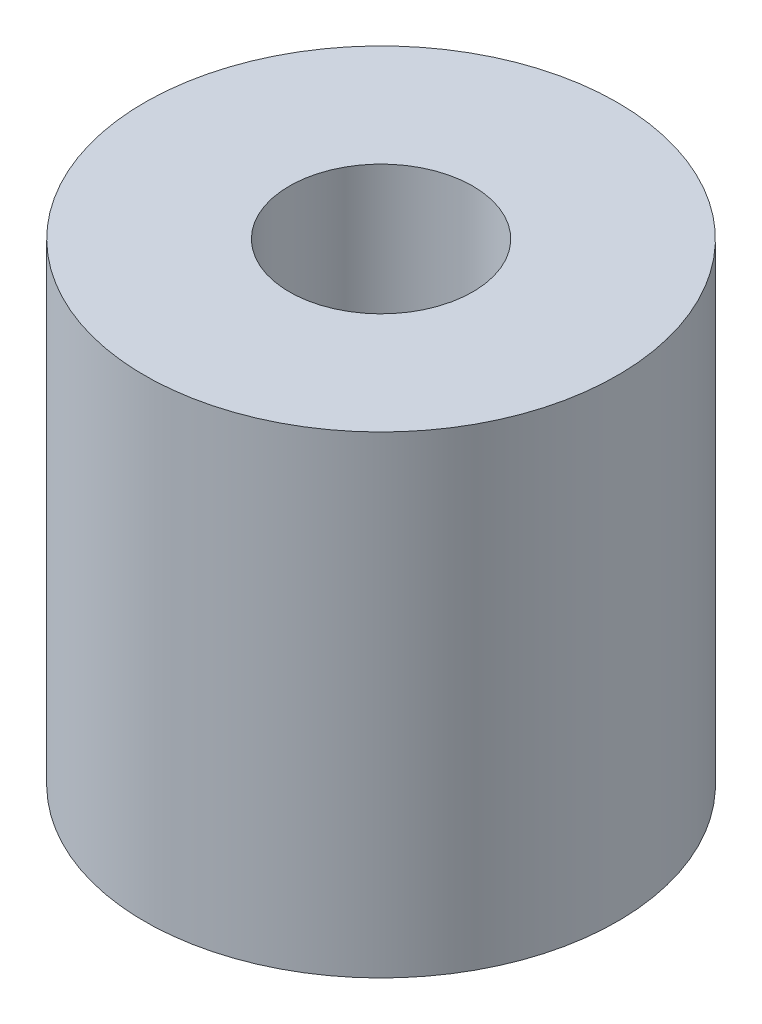
ISO-10303-21;
HEADER;
FILE_DESCRIPTION(('STEP AP214'),'2;1');
FILE_NAME('part.step','',(''),(''),'','','');
FILE_SCHEMA(('AUTOMOTIVE_DESIGN { 1 0 10303 214 1 1 1 1 }'));
ENDSEC;
DATA;
#1=APPLICATION_CONTEXT('core data for automotive mechanical design processes');
#2=APPLICATION_PROTOCOL_DEFINITION('international standard','automotive_design',2000,#1);
#3=PRODUCT_CONTEXT('',#1,'mechanical');
#4=PRODUCT('Part','Part','',(#3));
#5=PRODUCT_RELATED_PRODUCT_CATEGORY('part','',(#4));
#6=PRODUCT_DEFINITION_FORMATION('','',#4);
#7=PRODUCT_DEFINITION_CONTEXT('part definition',#1,'design');
#8=PRODUCT_DEFINITION('design','',#6,#7);
#9=PRODUCT_DEFINITION_SHAPE('','',#8);
#10=(LENGTH_UNIT() NAMED_UNIT(*) SI_UNIT(.MILLI.,.METRE.));
#11=(NAMED_UNIT(*) PLANE_ANGLE_UNIT() SI_UNIT($,.RADIAN.));
#12=(NAMED_UNIT(*) SI_UNIT($,.STERADIAN.) SOLID_ANGLE_UNIT());
#13=UNCERTAINTY_MEASURE_WITH_UNIT(LENGTH_MEASURE(1.E-05),#10,'distance_accuracy_value','');
#14=(GEOMETRIC_REPRESENTATION_CONTEXT(3) GLOBAL_UNCERTAINTY_ASSIGNED_CONTEXT((#13)) GLOBAL_UNIT_ASSIGNED_CONTEXT((#10,
#11,#12)) REPRESENTATION_CONTEXT('',''));
#15=CARTESIAN_POINT('',(0.,0.,0.));
#16=DIRECTION('',(0.,0.,1.));
#17=DIRECTION('',(1.,0.,0.));
#18=AXIS2_PLACEMENT_3D('',#15,#16,#17);
#19=CARTESIAN_POINT('',(0.,6.35,0.));
#20=DIRECTION('',(0.,-1.,0.));
#21=DIRECTION('',(0.,0.,-1.));
#22=AXIS2_PLACEMENT_3D('',#19,#20,#21);
#23=CYLINDRICAL_SURFACE('',#22,2.4638);
#24=CARTESIAN_POINT('',(0.,-6.35,0.));
#25=DIRECTION('',(0.,-1.,0.));
#26=DIRECTION('',(0.,0.,-1.));
#27=AXIS2_PLACEMENT_3D('',#24,#25,#26);
#28=CIRCLE('',#27,2.4638);
#29=CARTESIAN_POINT('',(0.,-6.35,-2.4638));
#30=VERTEX_POINT('',#29);
#31=EDGE_CURVE('E26',#30,#30,#28,.T.);
#32=ORIENTED_EDGE('',*,*,#31,.T.);
#33=EDGE_LOOP('',(#32));
#34=FACE_BOUND('',#33,.T.);
#35=CARTESIAN_POINT('',(0.,6.35,0.));
#36=DIRECTION('',(0.,-1.,0.));
#37=DIRECTION('',(0.,0.,-1.));
#38=AXIS2_PLACEMENT_3D('',#35,#36,#37);
#39=CIRCLE('',#38,2.4638);
#40=CARTESIAN_POINT('',(0.,6.35,-2.4638));
#41=VERTEX_POINT('',#40);
#42=EDGE_CURVE('E17',#41,#41,#39,.T.);
#43=ORIENTED_EDGE('',*,*,#42,.F.);
#44=EDGE_LOOP('',(#43));
#45=FACE_BOUND('',#44,.T.);
#46=ADVANCED_FACE('F14',(#34,#45),#23,.F.);
#47=CARTESIAN_POINT('',(0.,6.35,0.));
#48=DIRECTION('',(0.,1.,0.));
#49=DIRECTION('',(0.,0.,1.));
#50=AXIS2_PLACEMENT_3D('',#47,#48,#49);
#51=PLANE('',#50);
#52=ORIENTED_EDGE('',*,*,#42,.T.);
#53=EDGE_LOOP('',(#52));
#54=FACE_BOUND('',#53,.T.);
#55=CARTESIAN_POINT('',(0.,6.35,0.));
#56=DIRECTION('',(0.,-1.,0.));
#57=DIRECTION('',(0.,0.,-1.));
#58=AXIS2_PLACEMENT_3D('',#55,#56,#57);
#59=CIRCLE('',#58,6.35);
#60=CARTESIAN_POINT('',(0.,6.35,-6.35));
#61=VERTEX_POINT('',#60);
#62=EDGE_CURVE('E21',#61,#61,#59,.T.);
#63=ORIENTED_EDGE('',*,*,#62,.F.);
#64=EDGE_LOOP('',(#63));
#65=FACE_BOUND('',#64,.T.);
#66=ADVANCED_FACE('F34',(#54,#65),#51,.T.);
#67=CARTESIAN_POINT('',(0.,-6.35,0.));
#68=DIRECTION('',(0.,1.,0.));
#69=DIRECTION('',(0.,0.,1.));
#70=AXIS2_PLACEMENT_3D('',#67,#68,#69);
#71=PLANE('',#70);
#72=ORIENTED_EDGE('',*,*,#31,.F.);
#73=EDGE_LOOP('',(#72));
#74=FACE_BOUND('',#73,.T.);
#75=CARTESIAN_POINT('',(0.,-6.35,0.));
#76=DIRECTION('',(0.,-1.,0.));
#77=DIRECTION('',(0.,0.,-1.));
#78=AXIS2_PLACEMENT_3D('',#75,#76,#77);
#79=CIRCLE('',#78,6.35);
#80=CARTESIAN_POINT('',(0.,-6.35,-6.35));
#81=VERTEX_POINT('',#80);
#82=EDGE_CURVE('E10',#81,#81,#79,.F.);
#83=ORIENTED_EDGE('',*,*,#82,.F.);
#84=EDGE_LOOP('',(#83));
#85=FACE_BOUND('',#84,.T.);
#86=ADVANCED_FACE('F42',(#74,#85),#71,.F.);
#87=CARTESIAN_POINT('',(0.,6.35,0.));
#88=DIRECTION('',(0.,-1.,0.));
#89=DIRECTION('',(0.,0.,-1.));
#90=AXIS2_PLACEMENT_3D('',#87,#88,#89);
#91=CYLINDRICAL_SURFACE('',#90,6.35);
#92=ORIENTED_EDGE('',*,*,#62,.T.);
#93=EDGE_LOOP('',(#92));
#94=FACE_BOUND('',#93,.T.);
#95=ORIENTED_EDGE('',*,*,#82,.T.);
#96=EDGE_LOOP('',(#95));
#97=FACE_BOUND('',#96,.T.);
#98=ADVANCED_FACE('F43',(#94,#97),#91,.T.);
#99=CLOSED_SHELL('',(#46,#66,#86,#98));
#100=MANIFOLD_SOLID_BREP('B1',#99);
#101=ADVANCED_BREP_SHAPE_REPRESENTATION('',(#18,#100),#14);
#102=SHAPE_DEFINITION_REPRESENTATION(#9,#101);
ENDSEC;
END-ISO-10303-21;
